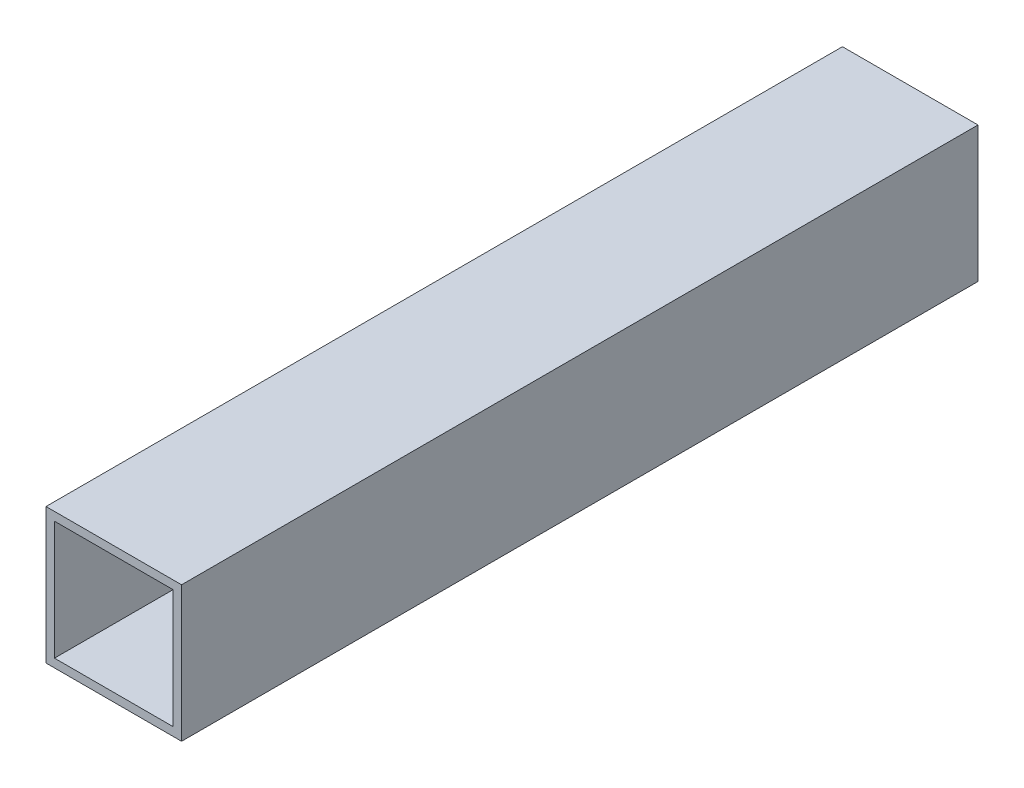
ISO-10303-21;
HEADER;
FILE_DESCRIPTION(('STEP AP214'),'2;1');
FILE_NAME('part.step','',(''),(''),'','','');
FILE_SCHEMA(('AUTOMOTIVE_DESIGN { 1 0 10303 214 1 1 1 1 }'));
ENDSEC;
DATA;
#1=APPLICATION_CONTEXT('core data for automotive mechanical design processes');
#2=APPLICATION_PROTOCOL_DEFINITION('international standard','automotive_design',2000,#1);
#3=PRODUCT_CONTEXT('',#1,'mechanical');
#4=PRODUCT('Part','Part','',(#3));
#5=PRODUCT_RELATED_PRODUCT_CATEGORY('part','',(#4));
#6=PRODUCT_DEFINITION_FORMATION('','',#4);
#7=PRODUCT_DEFINITION_CONTEXT('part definition',#1,'design');
#8=PRODUCT_DEFINITION('design','',#6,#7);
#9=PRODUCT_DEFINITION_SHAPE('','',#8);
#10=(LENGTH_UNIT() NAMED_UNIT(*) SI_UNIT(.MILLI.,.METRE.));
#11=(NAMED_UNIT(*) PLANE_ANGLE_UNIT() SI_UNIT($,.RADIAN.));
#12=(NAMED_UNIT(*) SI_UNIT($,.STERADIAN.) SOLID_ANGLE_UNIT());
#13=UNCERTAINTY_MEASURE_WITH_UNIT(LENGTH_MEASURE(1.E-05),#10,'distance_accuracy_value','');
#14=(GEOMETRIC_REPRESENTATION_CONTEXT(3) GLOBAL_UNCERTAINTY_ASSIGNED_CONTEXT((#13)) GLOBAL_UNIT_ASSIGNED_CONTEXT((#10,
#11,#12)) REPRESENTATION_CONTEXT('',''));
#15=CARTESIAN_POINT('',(0.,0.,0.));
#16=DIRECTION('',(0.,0.,1.));
#17=DIRECTION('',(1.,0.,0.));
#18=AXIS2_PLACEMENT_3D('',#15,#16,#17);
#19=CARTESIAN_POINT('',(0.,0.,76.2));
#20=DIRECTION('',(0.,0.,1.));
#21=DIRECTION('',(1.,0.,0.));
#22=AXIS2_PLACEMENT_3D('',#19,#20,#21);
#23=PLANE('',#22);
#24=DIRECTION('',(0.,-1.,0.));
#25=VECTOR('',#24,1.);
#26=CARTESIAN_POINT('',(-12.7,12.7,76.2));
#27=LINE('',#26,#25);
#28=CARTESIAN_POINT('',(-12.7,12.7,76.2));
#29=VERTEX_POINT('',#28);
#30=CARTESIAN_POINT('',(-12.7,-12.7,76.2));
#31=VERTEX_POINT('',#30);
#32=EDGE_CURVE('E147',#29,#31,#27,.T.);
#33=ORIENTED_EDGE('',*,*,#32,.T.);
#34=DIRECTION('',(1.,0.,0.));
#35=VECTOR('',#34,1.);
#36=CARTESIAN_POINT('',(-12.7,-12.7,76.2));
#37=LINE('',#36,#35);
#38=CARTESIAN_POINT('',(12.7,-12.7,76.2));
#39=VERTEX_POINT('',#38);
#40=EDGE_CURVE('E151',#31,#39,#37,.T.);
#41=ORIENTED_EDGE('',*,*,#40,.T.);
#42=DIRECTION('',(0.,1.,0.));
#43=VECTOR('',#42,1.);
#44=CARTESIAN_POINT('',(12.7,-12.7,76.2));
#45=LINE('',#44,#43);
#46=CARTESIAN_POINT('',(12.7,12.7,76.2));
#47=VERTEX_POINT('',#46);
#48=EDGE_CURVE('E154',#39,#47,#45,.T.);
#49=ORIENTED_EDGE('',*,*,#48,.T.);
#50=DIRECTION('',(-1.,0.,0.));
#51=VECTOR('',#50,1.);
#52=CARTESIAN_POINT('',(12.7,12.7,76.2));
#53=LINE('',#52,#51);
#54=EDGE_CURVE('E157',#47,#29,#53,.T.);
#55=ORIENTED_EDGE('',*,*,#54,.T.);
#56=EDGE_LOOP('',(#33,#41,#49,#55));
#57=FACE_BOUND('',#56,.T.);
#58=DIRECTION('',(1.,0.,0.));
#59=VECTOR('',#58,1.);
#60=CARTESIAN_POINT('',(-11.1125,-11.1125,76.2));
#61=LINE('',#60,#59);
#62=CARTESIAN_POINT('',(-11.1125,-11.1125,76.2));
#63=VERTEX_POINT('',#62);
#64=CARTESIAN_POINT('',(11.1125,-11.1125,76.2));
#65=VERTEX_POINT('',#64);
#66=EDGE_CURVE('E194',#63,#65,#61,.T.);
#67=ORIENTED_EDGE('',*,*,#66,.F.);
#68=DIRECTION('',(0.,-1.,0.));
#69=VECTOR('',#68,1.);
#70=CARTESIAN_POINT('',(-11.1125,11.1125,76.2));
#71=LINE('',#70,#69);
#72=CARTESIAN_POINT('',(-11.1125,11.1125,76.2));
#73=VERTEX_POINT('',#72);
#74=EDGE_CURVE('E191',#73,#63,#71,.T.);
#75=ORIENTED_EDGE('',*,*,#74,.F.);
#76=DIRECTION('',(-1.,0.,0.));
#77=VECTOR('',#76,1.);
#78=CARTESIAN_POINT('',(11.1125,11.1125,76.2));
#79=LINE('',#78,#77);
#80=CARTESIAN_POINT('',(11.1125,11.1125,76.2));
#81=VERTEX_POINT('',#80);
#82=EDGE_CURVE('E130',#81,#73,#79,.T.);
#83=ORIENTED_EDGE('',*,*,#82,.F.);
#84=DIRECTION('',(0.,1.,0.));
#85=VECTOR('',#84,1.);
#86=CARTESIAN_POINT('',(11.1125,-11.1125,76.2));
#87=LINE('',#86,#85);
#88=EDGE_CURVE('E138',#65,#81,#87,.T.);
#89=ORIENTED_EDGE('',*,*,#88,.F.);
#90=EDGE_LOOP('',(#67,#75,#83,#89));
#91=FACE_BOUND('',#90,.T.);
#92=ADVANCED_FACE('F44',(#57,#91),#23,.T.);
#93=CARTESIAN_POINT('',(-12.7,12.7,76.2));
#94=DIRECTION('',(1.,0.,0.));
#95=DIRECTION('',(0.,0.,-1.));
#96=AXIS2_PLACEMENT_3D('',#93,#94,#95);
#97=PLANE('',#96);
#98=DIRECTION('',(0.,0.,-1.));
#99=VECTOR('',#98,1.);
#100=CARTESIAN_POINT('',(-12.7,12.7,76.2));
#101=LINE('',#100,#99);
#102=CARTESIAN_POINT('',(-12.7,12.7,-73.0249999999999));
#103=VERTEX_POINT('',#102);
#104=EDGE_CURVE('E160',#29,#103,#101,.T.);
#105=ORIENTED_EDGE('',*,*,#104,.T.);
#106=DIRECTION('',(0.,1.,0.));
#107=VECTOR('',#106,1.);
#108=CARTESIAN_POINT('',(-12.7,-12.7,-73.0249999999999));
#109=LINE('',#108,#107);
#110=CARTESIAN_POINT('',(-12.7,-12.7,-73.0249999999999));
#111=VERTEX_POINT('',#110);
#112=EDGE_CURVE('E60',#111,#103,#109,.T.);
#113=ORIENTED_EDGE('',*,*,#112,.F.);
#114=DIRECTION('',(0.,0.,-1.));
#115=VECTOR('',#114,1.);
#116=CARTESIAN_POINT('',(-12.7,-12.7,76.2));
#117=LINE('',#116,#115);
#118=EDGE_CURVE('E12',#31,#111,#117,.T.);
#119=ORIENTED_EDGE('',*,*,#118,.F.);
#120=ORIENTED_EDGE('',*,*,#32,.F.);
#121=EDGE_LOOP('',(#105,#113,#119,#120));
#122=FACE_BOUND('',#121,.T.);
#123=ADVANCED_FACE('F46',(#122),#97,.F.);
#124=CARTESIAN_POINT('',(-12.7,-12.7,76.2));
#125=DIRECTION('',(0.,1.,0.));
#126=DIRECTION('',(-1.,0.,0.));
#127=AXIS2_PLACEMENT_3D('',#124,#125,#126);
#128=PLANE('',#127);
#129=ORIENTED_EDGE('',*,*,#118,.T.);
#130=DIRECTION('',(-1.,0.,0.));
#131=VECTOR('',#130,1.);
#132=CARTESIAN_POINT('',(12.7,-12.7,-73.0249999999999));
#133=LINE('',#132,#131);
#134=CARTESIAN_POINT('',(12.7,-12.7,-73.0249999999999));
#135=VERTEX_POINT('',#134);
#136=EDGE_CURVE('E179',#135,#111,#133,.T.);
#137=ORIENTED_EDGE('',*,*,#136,.F.);
#138=DIRECTION('',(0.,0.,-1.));
#139=VECTOR('',#138,1.);
#140=CARTESIAN_POINT('',(12.7,-12.7,76.2));
#141=LINE('',#140,#139);
#142=EDGE_CURVE('E53',#39,#135,#141,.T.);
#143=ORIENTED_EDGE('',*,*,#142,.F.);
#144=ORIENTED_EDGE('',*,*,#40,.F.);
#145=EDGE_LOOP('',(#129,#137,#143,#144));
#146=FACE_BOUND('',#145,.T.);
#147=ADVANCED_FACE('F178',(#146),#128,.F.);
#148=CARTESIAN_POINT('',(12.7,-12.7,76.2));
#149=DIRECTION('',(-1.,0.,0.));
#150=DIRECTION('',(0.,0.,1.));
#151=AXIS2_PLACEMENT_3D('',#148,#149,#150);
#152=PLANE('',#151);
#153=ORIENTED_EDGE('',*,*,#142,.T.);
#154=DIRECTION('',(0.,-1.,0.));
#155=VECTOR('',#154,1.);
#156=CARTESIAN_POINT('',(12.7,12.7,-73.0249999999999));
#157=LINE('',#156,#155);
#158=CARTESIAN_POINT('',(12.7,12.7,-73.0249999999999));
#159=VERTEX_POINT('',#158);
#160=EDGE_CURVE('E175',#159,#135,#157,.T.);
#161=ORIENTED_EDGE('',*,*,#160,.F.);
#162=DIRECTION('',(0.,0.,-1.));
#163=VECTOR('',#162,1.);
#164=CARTESIAN_POINT('',(12.7,12.7,76.2));
#165=LINE('',#164,#163);
#166=EDGE_CURVE('E164',#47,#159,#165,.T.);
#167=ORIENTED_EDGE('',*,*,#166,.F.);
#168=ORIENTED_EDGE('',*,*,#48,.F.);
#169=EDGE_LOOP('',(#153,#161,#167,#168));
#170=FACE_BOUND('',#169,.T.);
#171=ADVANCED_FACE('F173',(#170),#152,.F.);
#172=CARTESIAN_POINT('',(12.7,12.7,76.2));
#173=DIRECTION('',(0.,-1.,0.));
#174=DIRECTION('',(1.,0.,0.));
#175=AXIS2_PLACEMENT_3D('',#172,#173,#174);
#176=PLANE('',#175);
#177=ORIENTED_EDGE('',*,*,#166,.T.);
#178=DIRECTION('',(1.,0.,0.));
#179=VECTOR('',#178,1.);
#180=CARTESIAN_POINT('',(-12.7,12.7,-73.0249999999999));
#181=LINE('',#180,#179);
#182=EDGE_CURVE('E184',#103,#159,#181,.T.);
#183=ORIENTED_EDGE('',*,*,#182,.F.);
#184=ORIENTED_EDGE('',*,*,#104,.F.);
#185=ORIENTED_EDGE('',*,*,#54,.F.);
#186=EDGE_LOOP('',(#177,#183,#184,#185));
#187=FACE_BOUND('',#186,.T.);
#188=ADVANCED_FACE('F217',(#187),#176,.F.);
#189=CARTESIAN_POINT('',(-11.1125,11.1125,76.2));
#190=DIRECTION('',(1.,0.,0.));
#191=DIRECTION('',(0.,1.,0.));
#192=AXIS2_PLACEMENT_3D('',#189,#190,#191);
#193=PLANE('',#192);
#194=DIRECTION('',(0.,1.,0.));
#195=VECTOR('',#194,1.);
#196=CARTESIAN_POINT('',(-11.1125,11.1125,-73.0249999999999));
#197=LINE('',#196,#195);
#198=CARTESIAN_POINT('',(-11.1125,-11.1125,-73.0249999999999));
#199=VERTEX_POINT('',#198);
#200=CARTESIAN_POINT('',(-11.1125,11.1125,-73.0249999999999));
#201=VERTEX_POINT('',#200);
#202=EDGE_CURVE('E110',#199,#201,#197,.T.);
#203=ORIENTED_EDGE('',*,*,#202,.T.);
#204=DIRECTION('',(0.,0.,-1.));
#205=VECTOR('',#204,1.);
#206=CARTESIAN_POINT('',(-11.1125,11.1125,76.2));
#207=LINE('',#206,#205);
#208=EDGE_CURVE('E121',#73,#201,#207,.T.);
#209=ORIENTED_EDGE('',*,*,#208,.F.);
#210=ORIENTED_EDGE('',*,*,#74,.T.);
#211=DIRECTION('',(0.,0.,-1.));
#212=VECTOR('',#211,1.);
#213=CARTESIAN_POINT('',(-11.1125,-11.1125,76.2));
#214=LINE('',#213,#212);
#215=EDGE_CURVE('E124',#63,#199,#214,.T.);
#216=ORIENTED_EDGE('',*,*,#215,.T.);
#217=EDGE_LOOP('',(#203,#209,#210,#216));
#218=FACE_BOUND('',#217,.T.);
#219=ADVANCED_FACE('F120',(#218),#193,.T.);
#220=CARTESIAN_POINT('',(-11.1125,-11.1125,76.2));
#221=DIRECTION('',(0.,1.,0.));
#222=DIRECTION('',(0.,0.,1.));
#223=AXIS2_PLACEMENT_3D('',#220,#221,#222);
#224=PLANE('',#223);
#225=DIRECTION('',(-1.,0.,0.));
#226=VECTOR('',#225,1.);
#227=CARTESIAN_POINT('',(-11.1125,-11.1125,-73.0249999999999));
#228=LINE('',#227,#226);
#229=CARTESIAN_POINT('',(11.1125,-11.1125,-73.0249999999999));
#230=VERTEX_POINT('',#229);
#231=EDGE_CURVE('E126',#230,#199,#228,.T.);
#232=ORIENTED_EDGE('',*,*,#231,.T.);
#233=ORIENTED_EDGE('',*,*,#215,.F.);
#234=ORIENTED_EDGE('',*,*,#66,.T.);
#235=DIRECTION('',(0.,0.,-1.));
#236=VECTOR('',#235,1.);
#237=CARTESIAN_POINT('',(11.1125,-11.1125,76.2));
#238=LINE('',#237,#236);
#239=EDGE_CURVE('E136',#65,#230,#238,.T.);
#240=ORIENTED_EDGE('',*,*,#239,.T.);
#241=EDGE_LOOP('',(#232,#233,#234,#240));
#242=FACE_BOUND('',#241,.T.);
#243=ADVANCED_FACE('F205',(#242),#224,.T.);
#244=CARTESIAN_POINT('',(11.1125,-11.1125,76.2));
#245=DIRECTION('',(-1.,0.,0.));
#246=DIRECTION('',(0.,-1.,0.));
#247=AXIS2_PLACEMENT_3D('',#244,#245,#246);
#248=PLANE('',#247);
#249=DIRECTION('',(0.,-1.,0.));
#250=VECTOR('',#249,1.);
#251=CARTESIAN_POINT('',(11.1125,-11.1125,-73.0249999999999));
#252=LINE('',#251,#250);
#253=CARTESIAN_POINT('',(11.1125,11.1125,-73.0249999999999));
#254=VERTEX_POINT('',#253);
#255=EDGE_CURVE('E68',#254,#230,#252,.T.);
#256=ORIENTED_EDGE('',*,*,#255,.T.);
#257=ORIENTED_EDGE('',*,*,#239,.F.);
#258=ORIENTED_EDGE('',*,*,#88,.T.);
#259=DIRECTION('',(0.,0.,-1.));
#260=VECTOR('',#259,1.);
#261=CARTESIAN_POINT('',(11.1125,11.1125,76.2));
#262=LINE('',#261,#260);
#263=EDGE_CURVE('E132',#81,#254,#262,.T.);
#264=ORIENTED_EDGE('',*,*,#263,.T.);
#265=EDGE_LOOP('',(#256,#257,#258,#264));
#266=FACE_BOUND('',#265,.T.);
#267=ADVANCED_FACE('F201',(#266),#248,.T.);
#268=CARTESIAN_POINT('',(11.1125,11.1125,76.2));
#269=DIRECTION('',(0.,-1.,0.));
#270=DIRECTION('',(0.,0.,-1.));
#271=AXIS2_PLACEMENT_3D('',#268,#269,#270);
#272=PLANE('',#271);
#273=DIRECTION('',(1.,0.,0.));
#274=VECTOR('',#273,1.);
#275=CARTESIAN_POINT('',(11.1125,11.1125,-73.0249999999999));
#276=LINE('',#275,#274);
#277=EDGE_CURVE('E107',#201,#254,#276,.T.);
#278=ORIENTED_EDGE('',*,*,#277,.T.);
#279=ORIENTED_EDGE('',*,*,#263,.F.);
#280=ORIENTED_EDGE('',*,*,#82,.T.);
#281=ORIENTED_EDGE('',*,*,#208,.T.);
#282=EDGE_LOOP('',(#278,#279,#280,#281));
#283=FACE_BOUND('',#282,.T.);
#284=ADVANCED_FACE('F128',(#283),#272,.T.);
#285=CARTESIAN_POINT('',(0.,0.,-73.0249999999999));
#286=DIRECTION('',(0.,0.,1.));
#287=DIRECTION('',(1.,0.,0.));
#288=AXIS2_PLACEMENT_3D('',#285,#286,#287);
#289=PLANE('',#288);
#290=ORIENTED_EDGE('',*,*,#136,.T.);
#291=ORIENTED_EDGE('',*,*,#112,.T.);
#292=ORIENTED_EDGE('',*,*,#182,.T.);
#293=ORIENTED_EDGE('',*,*,#160,.T.);
#294=EDGE_LOOP('',(#290,#291,#292,#293));
#295=FACE_BOUND('',#294,.T.);
#296=ORIENTED_EDGE('',*,*,#231,.F.);
#297=ORIENTED_EDGE('',*,*,#255,.F.);
#298=ORIENTED_EDGE('',*,*,#277,.F.);
#299=ORIENTED_EDGE('',*,*,#202,.F.);
#300=EDGE_LOOP('',(#296,#297,#298,#299));
#301=FACE_BOUND('',#300,.T.);
#302=ADVANCED_FACE('F109',(#295,#301),#289,.F.);
#303=CLOSED_SHELL('',(#92,#123,#147,#171,#188,#219,#243,#267,#284,#302));
#304=MANIFOLD_SOLID_BREP('B2',#303);
#305=ADVANCED_BREP_SHAPE_REPRESENTATION('',(#18,#304),#14);
#306=SHAPE_DEFINITION_REPRESENTATION(#9,#305);
ENDSEC;
END-ISO-10303-21;
